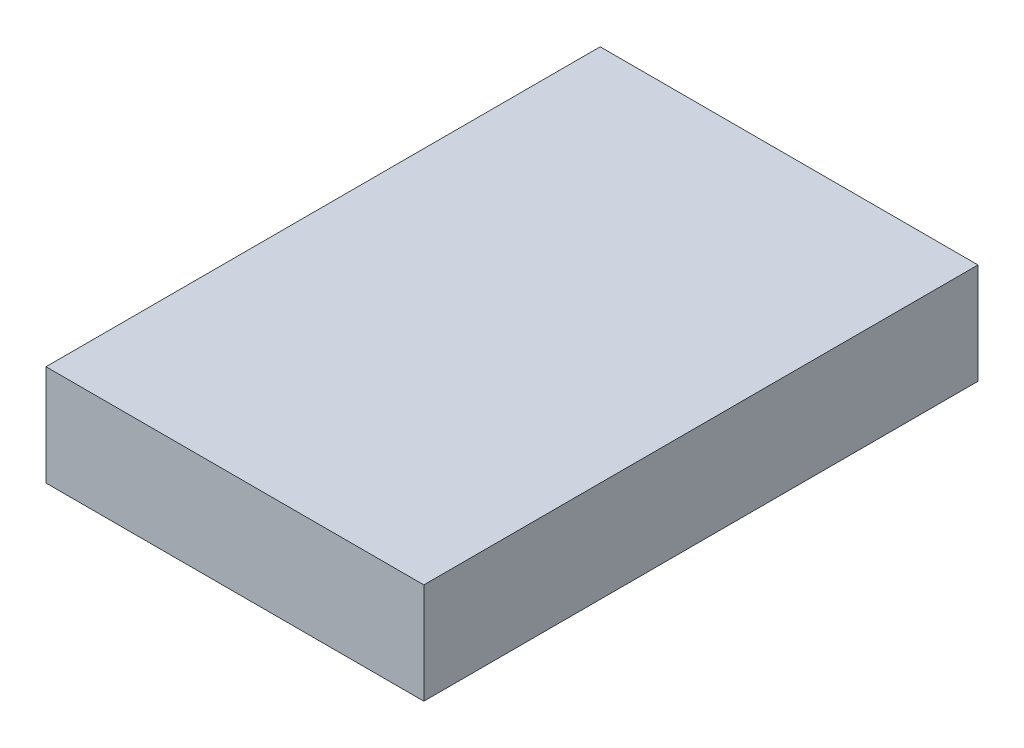
ISO-10303-21;
HEADER;
FILE_DESCRIPTION(('STEP AP214'),'2;1');
FILE_NAME('part.step','',(''),(''),'','','');
FILE_SCHEMA(('AUTOMOTIVE_DESIGN { 1 0 10303 214 1 1 1 1 }'));
ENDSEC;
DATA;
#1=APPLICATION_CONTEXT('core data for automotive mechanical design processes');
#2=APPLICATION_PROTOCOL_DEFINITION('international standard','automotive_design',2000,#1);
#3=PRODUCT_CONTEXT('',#1,'mechanical');
#4=PRODUCT('Part','Part','',(#3));
#5=PRODUCT_RELATED_PRODUCT_CATEGORY('part','',(#4));
#6=PRODUCT_DEFINITION_FORMATION('','',#4);
#7=PRODUCT_DEFINITION_CONTEXT('part definition',#1,'design');
#8=PRODUCT_DEFINITION('design','',#6,#7);
#9=PRODUCT_DEFINITION_SHAPE('','',#8);
#10=(LENGTH_UNIT() NAMED_UNIT(*) SI_UNIT(.MILLI.,.METRE.));
#11=(NAMED_UNIT(*) PLANE_ANGLE_UNIT() SI_UNIT($,.RADIAN.));
#12=(NAMED_UNIT(*) SI_UNIT($,.STERADIAN.) SOLID_ANGLE_UNIT());
#13=UNCERTAINTY_MEASURE_WITH_UNIT(LENGTH_MEASURE(1.E-05),#10,'distance_accuracy_value','');
#14=(GEOMETRIC_REPRESENTATION_CONTEXT(3) GLOBAL_UNCERTAINTY_ASSIGNED_CONTEXT((#13)) GLOBAL_UNIT_ASSIGNED_CONTEXT((#10,
#11,#12)) REPRESENTATION_CONTEXT('',''));
#15=CARTESIAN_POINT('',(0.,0.,0.));
#16=DIRECTION('',(0.,0.,1.));
#17=DIRECTION('',(1.,0.,0.));
#18=AXIS2_PLACEMENT_3D('',#15,#16,#17);
#19=CARTESIAN_POINT('',(0.,8.,0.));
#20=DIRECTION('',(1.,0.,0.));
#21=DIRECTION('',(0.,0.,-1.));
#22=AXIS2_PLACEMENT_3D('',#19,#20,#21);
#23=PLANE('',#22);
#24=DIRECTION('',(0.,0.,1.));
#25=VECTOR('',#24,1.);
#26=CARTESIAN_POINT('',(0.,0.,0.));
#27=LINE('',#26,#25);
#28=CARTESIAN_POINT('',(0.,0.,-44.));
#29=VERTEX_POINT('',#28);
#30=CARTESIAN_POINT('',(0.,0.,0.));
#31=VERTEX_POINT('',#30);
#32=EDGE_CURVE('E96',#29,#31,#27,.T.);
#33=ORIENTED_EDGE('',*,*,#32,.T.);
#34=DIRECTION('',(0.,-1.,0.));
#35=VECTOR('',#34,1.);
#36=CARTESIAN_POINT('',(0.,8.,0.));
#37=LINE('',#36,#35);
#38=CARTESIAN_POINT('',(0.,8.,0.));
#39=VERTEX_POINT('',#38);
#40=EDGE_CURVE('E11',#39,#31,#37,.T.);
#41=ORIENTED_EDGE('',*,*,#40,.F.);
#42=DIRECTION('',(0.,0.,1.));
#43=VECTOR('',#42,1.);
#44=CARTESIAN_POINT('',(0.,8.,0.));
#45=LINE('',#44,#43);
#46=CARTESIAN_POINT('',(0.,8.,-44.));
#47=VERTEX_POINT('',#46);
#48=EDGE_CURVE('E84',#47,#39,#45,.T.);
#49=ORIENTED_EDGE('',*,*,#48,.F.);
#50=DIRECTION('',(0.,-1.,0.));
#51=VECTOR('',#50,1.);
#52=CARTESIAN_POINT('',(0.,8.,-44.));
#53=LINE('',#52,#51);
#54=EDGE_CURVE('E92',#47,#29,#53,.T.);
#55=ORIENTED_EDGE('',*,*,#54,.T.);
#56=EDGE_LOOP('',(#33,#41,#49,#55));
#57=FACE_BOUND('',#56,.T.);
#58=ADVANCED_FACE('F33',(#57),#23,.F.);
#59=CARTESIAN_POINT('',(0.,8.,0.));
#60=DIRECTION('',(0.,0.,-1.));
#61=DIRECTION('',(-1.,0.,0.));
#62=AXIS2_PLACEMENT_3D('',#59,#60,#61);
#63=PLANE('',#62);
#64=DIRECTION('',(1.,0.,0.));
#65=VECTOR('',#64,1.);
#66=CARTESIAN_POINT('',(0.,0.,0.));
#67=LINE('',#66,#65);
#68=CARTESIAN_POINT('',(30.,0.,0.));
#69=VERTEX_POINT('',#68);
#70=EDGE_CURVE('E88',#31,#69,#67,.T.);
#71=ORIENTED_EDGE('',*,*,#70,.T.);
#72=DIRECTION('',(0.,-1.,0.));
#73=VECTOR('',#72,1.);
#74=CARTESIAN_POINT('',(30.,8.,0.));
#75=LINE('',#74,#73);
#76=CARTESIAN_POINT('',(30.,8.,0.));
#77=VERTEX_POINT('',#76);
#78=EDGE_CURVE('E41',#77,#69,#75,.T.);
#79=ORIENTED_EDGE('',*,*,#78,.F.);
#80=DIRECTION('',(1.,0.,0.));
#81=VECTOR('',#80,1.);
#82=CARTESIAN_POINT('',(0.,8.,0.));
#83=LINE('',#82,#81);
#84=EDGE_CURVE('E79',#39,#77,#83,.T.);
#85=ORIENTED_EDGE('',*,*,#84,.F.);
#86=ORIENTED_EDGE('',*,*,#40,.T.);
#87=EDGE_LOOP('',(#71,#79,#85,#86));
#88=FACE_BOUND('',#87,.T.);
#89=ADVANCED_FACE('F87',(#88),#63,.F.);
#90=CARTESIAN_POINT('',(30.,8.,0.));
#91=DIRECTION('',(-1.,0.,0.));
#92=DIRECTION('',(0.,0.,1.));
#93=AXIS2_PLACEMENT_3D('',#90,#91,#92);
#94=PLANE('',#93);
#95=DIRECTION('',(0.,0.,-1.));
#96=VECTOR('',#95,1.);
#97=CARTESIAN_POINT('',(30.,0.,0.));
#98=LINE('',#97,#96);
#99=CARTESIAN_POINT('',(30.,0.,-44.));
#100=VERTEX_POINT('',#99);
#101=EDGE_CURVE('E66',#69,#100,#98,.T.);
#102=ORIENTED_EDGE('',*,*,#101,.T.);
#103=DIRECTION('',(0.,-1.,0.));
#104=VECTOR('',#103,1.);
#105=CARTESIAN_POINT('',(30.,8.,-44.));
#106=LINE('',#105,#104);
#107=CARTESIAN_POINT('',(30.,8.,-44.));
#108=VERTEX_POINT('',#107);
#109=EDGE_CURVE('E89',#108,#100,#106,.T.);
#110=ORIENTED_EDGE('',*,*,#109,.F.);
#111=DIRECTION('',(0.,0.,-1.));
#112=VECTOR('',#111,1.);
#113=CARTESIAN_POINT('',(30.,8.,0.));
#114=LINE('',#113,#112);
#115=EDGE_CURVE('E82',#77,#108,#114,.T.);
#116=ORIENTED_EDGE('',*,*,#115,.F.);
#117=ORIENTED_EDGE('',*,*,#78,.T.);
#118=EDGE_LOOP('',(#102,#110,#116,#117));
#119=FACE_BOUND('',#118,.T.);
#120=ADVANCED_FACE('F90',(#119),#94,.F.);
#121=CARTESIAN_POINT('',(0.,8.,-44.));
#122=DIRECTION('',(0.,0.,1.));
#123=DIRECTION('',(1.,0.,0.));
#124=AXIS2_PLACEMENT_3D('',#121,#122,#123);
#125=PLANE('',#124);
#126=DIRECTION('',(-1.,0.,0.));
#127=VECTOR('',#126,1.);
#128=CARTESIAN_POINT('',(0.,0.,-44.));
#129=LINE('',#128,#127);
#130=EDGE_CURVE('E72',#100,#29,#129,.T.);
#131=ORIENTED_EDGE('',*,*,#130,.T.);
#132=ORIENTED_EDGE('',*,*,#54,.F.);
#133=DIRECTION('',(-1.,0.,0.));
#134=VECTOR('',#133,1.);
#135=CARTESIAN_POINT('',(0.,8.,-44.));
#136=LINE('',#135,#134);
#137=EDGE_CURVE('E49',#108,#47,#136,.T.);
#138=ORIENTED_EDGE('',*,*,#137,.F.);
#139=ORIENTED_EDGE('',*,*,#109,.T.);
#140=EDGE_LOOP('',(#131,#132,#138,#139));
#141=FACE_BOUND('',#140,.T.);
#142=ADVANCED_FACE('F103',(#141),#125,.F.);
#143=CARTESIAN_POINT('',(0.,8.,0.));
#144=DIRECTION('',(0.,-1.,0.));
#145=DIRECTION('',(0.,0.,-1.));
#146=AXIS2_PLACEMENT_3D('',#143,#144,#145);
#147=PLANE('',#146);
#148=ORIENTED_EDGE('',*,*,#48,.T.);
#149=ORIENTED_EDGE('',*,*,#84,.T.);
#150=ORIENTED_EDGE('',*,*,#115,.T.);
#151=ORIENTED_EDGE('',*,*,#137,.T.);
#152=EDGE_LOOP('',(#148,#149,#150,#151));
#153=FACE_BOUND('',#152,.T.);
#154=ADVANCED_FACE('F80',(#153),#147,.F.);
#155=CARTESIAN_POINT('',(0.,0.,0.));
#156=DIRECTION('',(0.,-1.,0.));
#157=DIRECTION('',(0.,0.,-1.));
#158=AXIS2_PLACEMENT_3D('',#155,#156,#157);
#159=PLANE('',#158);
#160=ORIENTED_EDGE('',*,*,#32,.F.);
#161=ORIENTED_EDGE('',*,*,#130,.F.);
#162=ORIENTED_EDGE('',*,*,#101,.F.);
#163=ORIENTED_EDGE('',*,*,#70,.F.);
#164=EDGE_LOOP('',(#160,#161,#162,#163));
#165=FACE_BOUND('',#164,.T.);
#166=ADVANCED_FACE('F106',(#165),#159,.T.);
#167=CLOSED_SHELL('',(#58,#89,#120,#142,#154,#166));
#168=MANIFOLD_SOLID_BREP('B2',#167);
#169=ADVANCED_BREP_SHAPE_REPRESENTATION('',(#18,#168),#14);
#170=SHAPE_DEFINITION_REPRESENTATION(#9,#169);
ENDSEC;
END-ISO-10303-21;
